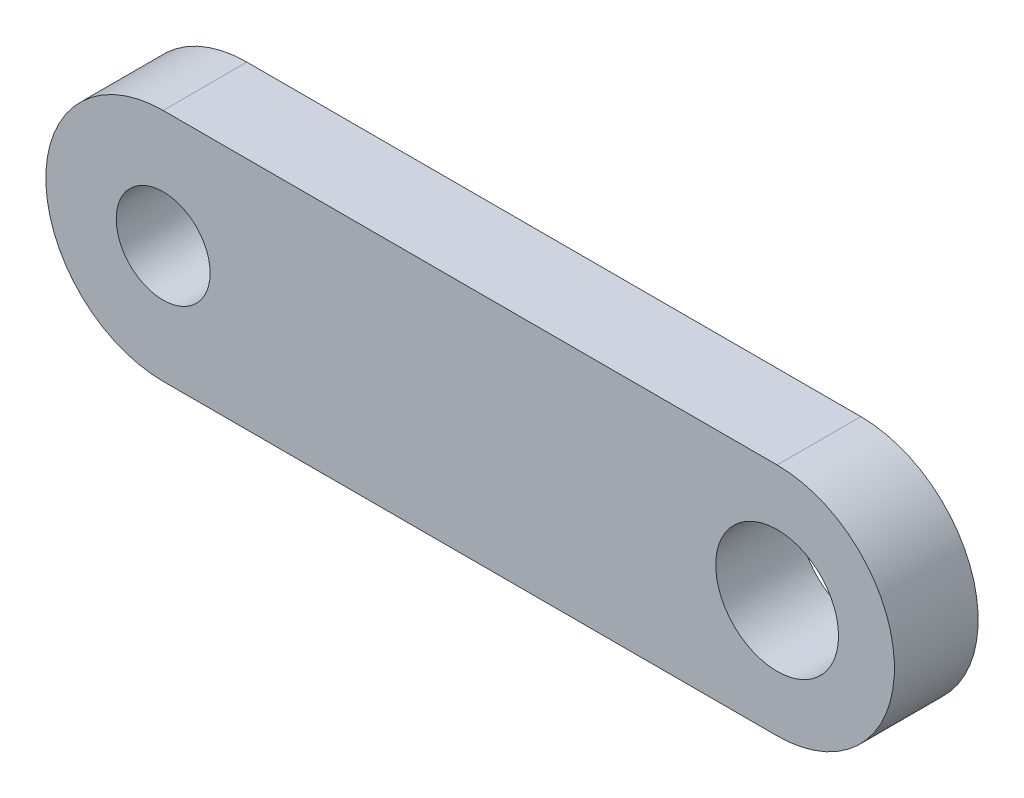
ISO-10303-21;
HEADER;
FILE_DESCRIPTION(('STEP AP214'),'2;1');
FILE_NAME('part.step','',(''),(''),'','','');
FILE_SCHEMA(('AUTOMOTIVE_DESIGN { 1 0 10303 214 1 1 1 1 }'));
ENDSEC;
DATA;
#1=APPLICATION_CONTEXT('core data for automotive mechanical design processes');
#2=APPLICATION_PROTOCOL_DEFINITION('international standard','automotive_design',2000,#1);
#3=PRODUCT_CONTEXT('',#1,'mechanical');
#4=PRODUCT('Part','Part','',(#3));
#5=PRODUCT_RELATED_PRODUCT_CATEGORY('part','',(#4));
#6=PRODUCT_DEFINITION_FORMATION('','',#4);
#7=PRODUCT_DEFINITION_CONTEXT('part definition',#1,'design');
#8=PRODUCT_DEFINITION('design','',#6,#7);
#9=PRODUCT_DEFINITION_SHAPE('','',#8);
#10=(LENGTH_UNIT() NAMED_UNIT(*) SI_UNIT(.MILLI.,.METRE.));
#11=(NAMED_UNIT(*) PLANE_ANGLE_UNIT() SI_UNIT($,.RADIAN.));
#12=(NAMED_UNIT(*) SI_UNIT($,.STERADIAN.) SOLID_ANGLE_UNIT());
#13=UNCERTAINTY_MEASURE_WITH_UNIT(LENGTH_MEASURE(1.E-05),#10,'distance_accuracy_value','');
#14=(GEOMETRIC_REPRESENTATION_CONTEXT(3) GLOBAL_UNCERTAINTY_ASSIGNED_CONTEXT((#13)) GLOBAL_UNIT_ASSIGNED_CONTEXT((#10,
#11,#12)) REPRESENTATION_CONTEXT('',''));
#15=CARTESIAN_POINT('',(0.,0.,0.));
#16=DIRECTION('',(0.,0.,1.));
#17=DIRECTION('',(1.,0.,0.));
#18=AXIS2_PLACEMENT_3D('',#15,#16,#17);
#19=CARTESIAN_POINT('',(58.8819721331395,54.3529410920303,3.));
#20=DIRECTION('',(0.,0.,1.));
#21=DIRECTION('',(1.,0.,0.));
#22=AXIS2_PLACEMENT_3D('',#19,#20,#21);
#23=PLANE('',#22);
#24=CARTESIAN_POINT('',(80.8819721217468,54.3522330815261,3.));
#25=DIRECTION('',(0.,0.,1.));
#26=DIRECTION('',(1.,0.,0.));
#27=AXIS2_PLACEMENT_3D('',#24,#25,#26);
#28=CIRCLE('',#27,2.19999999658217);
#29=CARTESIAN_POINT('',(83.0819721183289,54.3522330815261,3.));
#30=VERTEX_POINT('',#29);
#31=EDGE_CURVE('E101',#30,#30,#28,.T.);
#32=ORIENTED_EDGE('',*,*,#31,.F.);
#33=EDGE_LOOP('',(#32));
#34=FACE_BOUND('',#33,.T.);
#35=CARTESIAN_POINT('',(58.8819721331395,54.3529410920303,3.));
#36=DIRECTION('',(0.,0.,1.));
#37=DIRECTION('',(1.,0.,0.));
#38=AXIS2_PLACEMENT_3D('',#35,#36,#37);
#39=CIRCLE('',#38,4.20371442774855);
#40=CARTESIAN_POINT('',(58.881972110354,58.5566555197789,3.));
#41=VERTEX_POINT('',#40);
#42=CARTESIAN_POINT('',(58.8819721559249,50.1492266642818,3.));
#43=VERTEX_POINT('',#42);
#44=EDGE_CURVE('E86',#41,#43,#39,.T.);
#45=ORIENTED_EDGE('',*,*,#44,.T.);
#46=DIRECTION('',(1.,0.,0.));
#47=VECTOR('',#46,1.);
#48=CARTESIAN_POINT('',(58.8819721559249,50.1492266642818,3.));
#49=LINE('',#48,#47);
#50=CARTESIAN_POINT('',(80.8819721217468,50.1492266642818,3.));
#51=VERTEX_POINT('',#50);
#52=EDGE_CURVE('E81',#43,#51,#49,.T.);
#53=ORIENTED_EDGE('',*,*,#52,.T.);
#54=CARTESIAN_POINT('',(80.8819721217468,54.3529410920303,3.));
#55=DIRECTION('',(0.,0.,1.));
#56=DIRECTION('',(1.,0.,0.));
#57=AXIS2_PLACEMENT_3D('',#54,#55,#56);
#58=CIRCLE('',#57,4.20371442774851);
#59=CARTESIAN_POINT('',(80.8819721217468,58.5566555197789,3.));
#60=VERTEX_POINT('',#59);
#61=EDGE_CURVE('E84',#51,#60,#58,.T.);
#62=ORIENTED_EDGE('',*,*,#61,.T.);
#63=DIRECTION('',(-1.,0.,0.));
#64=VECTOR('',#63,1.);
#65=CARTESIAN_POINT('',(58.881972110354,58.5566555197789,3.));
#66=LINE('',#65,#64);
#67=EDGE_CURVE('E51',#60,#41,#66,.T.);
#68=ORIENTED_EDGE('',*,*,#67,.T.);
#69=EDGE_LOOP('',(#45,#53,#62,#68));
#70=FACE_BOUND('',#69,.T.);
#71=CARTESIAN_POINT('',(58.8819721331395,54.3529410920303,3.));
#72=DIRECTION('',(0.,0.,1.));
#73=DIRECTION('',(1.,0.,0.));
#74=AXIS2_PLACEMENT_3D('',#71,#72,#73);
#75=CIRCLE('',#74,1.68235293856284);
#76=CARTESIAN_POINT('',(60.5643250717023,54.3529410920303,3.));
#77=VERTEX_POINT('',#76);
#78=EDGE_CURVE('E116',#77,#77,#75,.T.);
#79=ORIENTED_EDGE('',*,*,#78,.F.);
#80=EDGE_LOOP('',(#79));
#81=FACE_BOUND('',#80,.T.);
#82=ADVANCED_FACE('F34',(#34,#70,#81),#23,.T.);
#83=CARTESIAN_POINT('',(58.8819721331395,54.3529410920303,0.));
#84=DIRECTION('',(0.,0.,1.));
#85=DIRECTION('',(1.,0.,0.));
#86=AXIS2_PLACEMENT_3D('',#83,#84,#85);
#87=PLANE('',#86);
#88=CARTESIAN_POINT('',(58.8819721331395,54.3529410920303,0.));
#89=DIRECTION('',(0.,0.,1.));
#90=DIRECTION('',(1.,0.,0.));
#91=AXIS2_PLACEMENT_3D('',#88,#89,#90);
#92=CIRCLE('',#91,4.20371442774855);
#93=CARTESIAN_POINT('',(58.881972110354,58.5566555197789,0.));
#94=VERTEX_POINT('',#93);
#95=CARTESIAN_POINT('',(58.8819721559249,50.1492266642818,0.));
#96=VERTEX_POINT('',#95);
#97=EDGE_CURVE('E98',#94,#96,#92,.T.);
#98=ORIENTED_EDGE('',*,*,#97,.F.);
#99=DIRECTION('',(-1.,0.,0.));
#100=VECTOR('',#99,1.);
#101=CARTESIAN_POINT('',(58.881972110354,58.5566555197789,0.));
#102=LINE('',#101,#100);
#103=CARTESIAN_POINT('',(80.8819721217468,58.5566555197789,0.));
#104=VERTEX_POINT('',#103);
#105=EDGE_CURVE('E74',#104,#94,#102,.T.);
#106=ORIENTED_EDGE('',*,*,#105,.F.);
#107=CARTESIAN_POINT('',(80.8819721217468,54.3529410920303,0.));
#108=DIRECTION('',(0.,0.,1.));
#109=DIRECTION('',(1.,0.,0.));
#110=AXIS2_PLACEMENT_3D('',#107,#108,#109);
#111=CIRCLE('',#110,4.20371442774851);
#112=CARTESIAN_POINT('',(80.8819721217468,50.1492266642818,0.));
#113=VERTEX_POINT('',#112);
#114=EDGE_CURVE('E68',#113,#104,#111,.T.);
#115=ORIENTED_EDGE('',*,*,#114,.F.);
#116=DIRECTION('',(1.,0.,0.));
#117=VECTOR('',#116,1.);
#118=CARTESIAN_POINT('',(78.9995462714351,50.1492266642819,0.));
#119=LINE('',#118,#117);
#120=EDGE_CURVE('E90',#96,#113,#119,.T.);
#121=ORIENTED_EDGE('',*,*,#120,.F.);
#122=EDGE_LOOP('',(#98,#106,#115,#121));
#123=FACE_BOUND('',#122,.T.);
#124=CARTESIAN_POINT('',(80.8819721217468,54.3522330815261,0.));
#125=DIRECTION('',(0.,0.,1.));
#126=DIRECTION('',(1.,0.,0.));
#127=AXIS2_PLACEMENT_3D('',#124,#125,#126);
#128=CIRCLE('',#127,2.19999999658217);
#129=CARTESIAN_POINT('',(83.0819721183289,54.3522330815261,0.));
#130=VERTEX_POINT('',#129);
#131=EDGE_CURVE('E113',#130,#130,#128,.T.);
#132=ORIENTED_EDGE('',*,*,#131,.T.);
#133=EDGE_LOOP('',(#132));
#134=FACE_BOUND('',#133,.T.);
#135=CARTESIAN_POINT('',(58.8819721331395,54.3529410920303,0.));
#136=DIRECTION('',(0.,0.,1.));
#137=DIRECTION('',(1.,0.,0.));
#138=AXIS2_PLACEMENT_3D('',#135,#136,#137);
#139=CIRCLE('',#138,1.68235293856284);
#140=CARTESIAN_POINT('',(60.5643250717023,54.3529410920303,0.));
#141=VERTEX_POINT('',#140);
#142=EDGE_CURVE('E119',#141,#141,#139,.T.);
#143=ORIENTED_EDGE('',*,*,#142,.T.);
#144=EDGE_LOOP('',(#143));
#145=FACE_BOUND('',#144,.T.);
#146=ADVANCED_FACE('F109',(#123,#134,#145),#87,.F.);
#147=CARTESIAN_POINT('',(58.8819721331395,54.3529410920303,3.));
#148=DIRECTION('',(0.,0.,-1.));
#149=DIRECTION('',(-1.,0.,0.));
#150=AXIS2_PLACEMENT_3D('',#147,#148,#149);
#151=CYLINDRICAL_SURFACE('',#150,4.20371442774855);
#152=ORIENTED_EDGE('',*,*,#97,.T.);
#153=DIRECTION('',(0.,0.,-1.));
#154=VECTOR('',#153,1.);
#155=CARTESIAN_POINT('',(58.8819721559249,50.1492266642818,3.));
#156=LINE('',#155,#154);
#157=EDGE_CURVE('E11',#43,#96,#156,.T.);
#158=ORIENTED_EDGE('',*,*,#157,.F.);
#159=ORIENTED_EDGE('',*,*,#44,.F.);
#160=DIRECTION('',(0.,0.,-1.));
#161=VECTOR('',#160,1.);
#162=CARTESIAN_POINT('',(58.881972110354,58.5566555197789,3.));
#163=LINE('',#162,#161);
#164=EDGE_CURVE('E94',#41,#94,#163,.T.);
#165=ORIENTED_EDGE('',*,*,#164,.T.);
#166=EDGE_LOOP('',(#152,#158,#159,#165));
#167=FACE_BOUND('',#166,.T.);
#168=ADVANCED_FACE('F36',(#167),#151,.T.);
#169=CARTESIAN_POINT('',(78.9995462714351,50.1492266642819,3.));
#170=DIRECTION('',(0.,1.,0.));
#171=DIRECTION('',(-1.,0.,0.));
#172=AXIS2_PLACEMENT_3D('',#169,#170,#171);
#173=PLANE('',#172);
#174=ORIENTED_EDGE('',*,*,#120,.T.);
#175=DIRECTION('',(0.,0.,-1.));
#176=VECTOR('',#175,1.);
#177=CARTESIAN_POINT('',(80.8819721217468,50.1492266642818,3.));
#178=LINE('',#177,#176);
#179=EDGE_CURVE('E43',#51,#113,#178,.T.);
#180=ORIENTED_EDGE('',*,*,#179,.F.);
#181=ORIENTED_EDGE('',*,*,#52,.F.);
#182=ORIENTED_EDGE('',*,*,#157,.T.);
#183=EDGE_LOOP('',(#174,#180,#181,#182));
#184=FACE_BOUND('',#183,.T.);
#185=ADVANCED_FACE('F89',(#184),#173,.F.);
#186=CARTESIAN_POINT('',(80.8819721217468,54.3529410920303,3.));
#187=DIRECTION('',(0.,0.,-1.));
#188=DIRECTION('',(-1.,0.,0.));
#189=AXIS2_PLACEMENT_3D('',#186,#187,#188);
#190=CYLINDRICAL_SURFACE('',#189,4.20371442774851);
#191=ORIENTED_EDGE('',*,*,#114,.T.);
#192=DIRECTION('',(0.,0.,-1.));
#193=VECTOR('',#192,1.);
#194=CARTESIAN_POINT('',(80.8819721217468,58.5566555197789,3.));
#195=LINE('',#194,#193);
#196=EDGE_CURVE('E91',#60,#104,#195,.T.);
#197=ORIENTED_EDGE('',*,*,#196,.F.);
#198=ORIENTED_EDGE('',*,*,#61,.F.);
#199=ORIENTED_EDGE('',*,*,#179,.T.);
#200=EDGE_LOOP('',(#191,#197,#198,#199));
#201=FACE_BOUND('',#200,.T.);
#202=ADVANCED_FACE('F92',(#201),#190,.T.);
#203=CARTESIAN_POINT('',(58.881972110354,58.5566555197789,3.));
#204=DIRECTION('',(0.,-1.,0.));
#205=DIRECTION('',(1.,0.,0.));
#206=AXIS2_PLACEMENT_3D('',#203,#204,#205);
#207=PLANE('',#206);
#208=ORIENTED_EDGE('',*,*,#105,.T.);
#209=ORIENTED_EDGE('',*,*,#164,.F.);
#210=ORIENTED_EDGE('',*,*,#67,.F.);
#211=ORIENTED_EDGE('',*,*,#196,.T.);
#212=EDGE_LOOP('',(#208,#209,#210,#211));
#213=FACE_BOUND('',#212,.T.);
#214=ADVANCED_FACE('F106',(#213),#207,.F.);
#215=CARTESIAN_POINT('',(80.8819721217468,54.3522330815261,3.));
#216=DIRECTION('',(0.,0.,-1.));
#217=DIRECTION('',(-1.,0.,0.));
#218=AXIS2_PLACEMENT_3D('',#215,#216,#217);
#219=CYLINDRICAL_SURFACE('',#218,2.19999999658217);
#220=ORIENTED_EDGE('',*,*,#31,.T.);
#221=EDGE_LOOP('',(#220));
#222=FACE_BOUND('',#221,.T.);
#223=ORIENTED_EDGE('',*,*,#131,.F.);
#224=EDGE_LOOP('',(#223));
#225=FACE_BOUND('',#224,.T.);
#226=ADVANCED_FACE('F136',(#222,#225),#219,.F.);
#227=CARTESIAN_POINT('',(58.8819721331395,54.3529410920303,3.));
#228=DIRECTION('',(0.,0.,-1.));
#229=DIRECTION('',(-1.,0.,0.));
#230=AXIS2_PLACEMENT_3D('',#227,#228,#229);
#231=CYLINDRICAL_SURFACE('',#230,1.68235293856284);
#232=ORIENTED_EDGE('',*,*,#78,.T.);
#233=EDGE_LOOP('',(#232));
#234=FACE_BOUND('',#233,.T.);
#235=ORIENTED_EDGE('',*,*,#142,.F.);
#236=EDGE_LOOP('',(#235));
#237=FACE_BOUND('',#236,.T.);
#238=ADVANCED_FACE('F125',(#234,#237),#231,.F.);
#239=CLOSED_SHELL('',(#82,#146,#168,#185,#202,#214,#226,#238));
#240=MANIFOLD_SOLID_BREP('B2',#239);
#241=ADVANCED_BREP_SHAPE_REPRESENTATION('',(#18,#240),#14);
#242=SHAPE_DEFINITION_REPRESENTATION(#9,#241);
ENDSEC;
END-ISO-10303-21;
